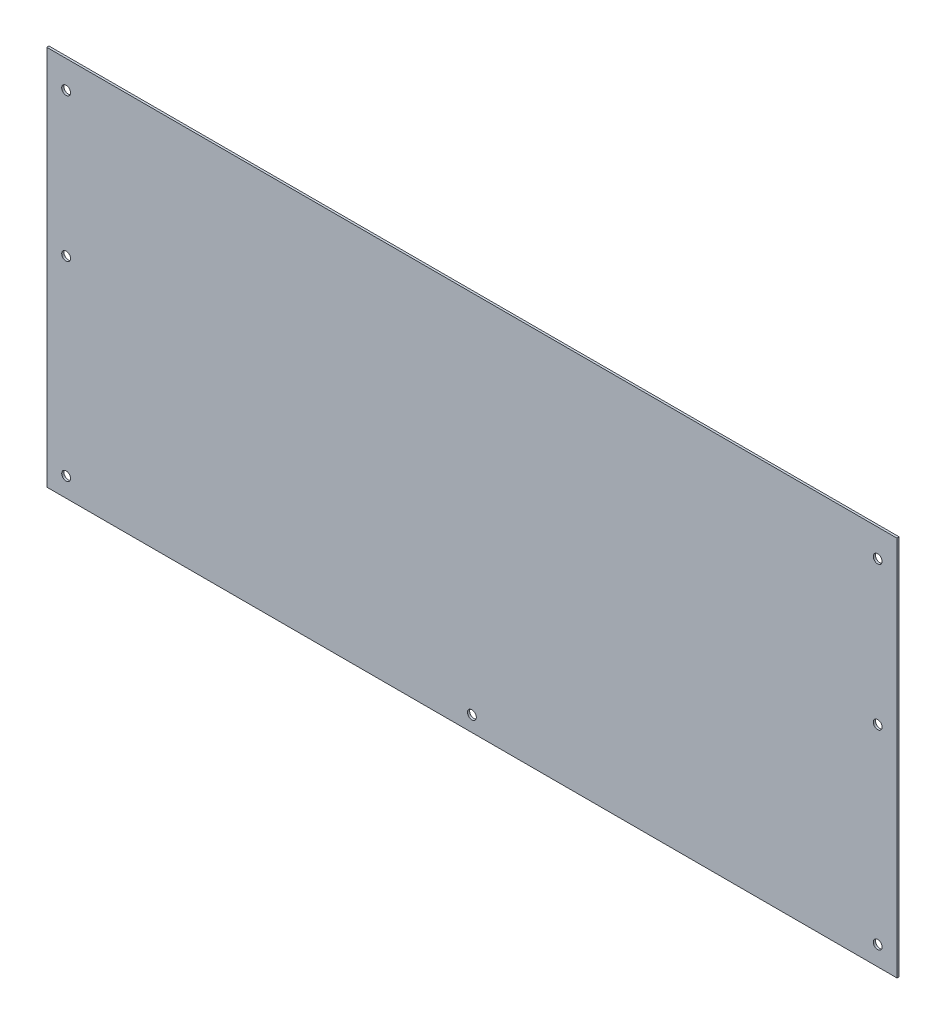
ISO-10303-21;
HEADER;
FILE_DESCRIPTION(('STEP AP214'),'2;1');
FILE_NAME('part.step','',(''),(''),'','','');
FILE_SCHEMA(('AUTOMOTIVE_DESIGN { 1 0 10303 214 1 1 1 1 }'));
ENDSEC;
DATA;
#1=APPLICATION_CONTEXT('core data for automotive mechanical design processes');
#2=APPLICATION_PROTOCOL_DEFINITION('international standard','automotive_design',2000,#1);
#3=PRODUCT_CONTEXT('',#1,'mechanical');
#4=PRODUCT('Part','Part','',(#3));
#5=PRODUCT_RELATED_PRODUCT_CATEGORY('part','',(#4));
#6=PRODUCT_DEFINITION_FORMATION('','',#4);
#7=PRODUCT_DEFINITION_CONTEXT('part definition',#1,'design');
#8=PRODUCT_DEFINITION('design','',#6,#7);
#9=PRODUCT_DEFINITION_SHAPE('','',#8);
#10=(LENGTH_UNIT() NAMED_UNIT(*) SI_UNIT(.MILLI.,.METRE.));
#11=(NAMED_UNIT(*) PLANE_ANGLE_UNIT() SI_UNIT($,.RADIAN.));
#12=(NAMED_UNIT(*) SI_UNIT($,.STERADIAN.) SOLID_ANGLE_UNIT());
#13=UNCERTAINTY_MEASURE_WITH_UNIT(LENGTH_MEASURE(1.E-05),#10,'distance_accuracy_value','');
#14=(GEOMETRIC_REPRESENTATION_CONTEXT(3) GLOBAL_UNCERTAINTY_ASSIGNED_CONTEXT((#13)) GLOBAL_UNIT_ASSIGNED_CONTEXT((#10,
#11,#12)) REPRESENTATION_CONTEXT('',''));
#15=CARTESIAN_POINT('',(0.,0.,0.));
#16=DIRECTION('',(0.,0.,1.));
#17=DIRECTION('',(1.,0.,0.));
#18=AXIS2_PLACEMENT_3D('',#15,#16,#17);
#19=CARTESIAN_POINT('',(0.,0.,2.));
#20=DIRECTION('',(0.,0.,1.));
#21=DIRECTION('',(1.,0.,0.));
#22=AXIS2_PLACEMENT_3D('',#19,#20,#21);
#23=PLANE('',#22);
#24=CARTESIAN_POINT('',(752.5,190.,2.));
#25=DIRECTION('',(0.,0.,1.));
#26=DIRECTION('',(-1.,0.,0.));
#27=AXIS2_PLACEMENT_3D('',#24,#25,#26);
#28=CIRCLE('',#27,3.99999999999999);
#29=CARTESIAN_POINT('',(748.5,190.,2.));
#30=VERTEX_POINT('',#29);
#31=EDGE_CURVE('E138',#30,#30,#28,.T.);
#32=ORIENTED_EDGE('',*,*,#31,.F.);
#33=EDGE_LOOP('',(#32));
#34=FACE_BOUND('',#33,.T.);
#35=CARTESIAN_POINT('',(752.5,17.5000000000001,2.));
#36=DIRECTION('',(0.,0.,1.));
#37=DIRECTION('',(-1.,0.,0.));
#38=AXIS2_PLACEMENT_3D('',#35,#36,#37);
#39=CIRCLE('',#38,3.99999999999999);
#40=CARTESIAN_POINT('',(748.5,17.5000000000001,2.));
#41=VERTEX_POINT('',#40);
#42=EDGE_CURVE('E126',#41,#41,#39,.T.);
#43=ORIENTED_EDGE('',*,*,#42,.F.);
#44=EDGE_LOOP('',(#43));
#45=FACE_BOUND('',#44,.T.);
#46=CARTESIAN_POINT('',(17.5,17.5,2.));
#47=DIRECTION('',(0.,0.,1.));
#48=DIRECTION('',(1.,0.,0.));
#49=AXIS2_PLACEMENT_3D('',#46,#47,#48);
#50=CIRCLE('',#49,4.00000000000001);
#51=CARTESIAN_POINT('',(21.5000000000001,17.5,2.));
#52=VERTEX_POINT('',#51);
#53=EDGE_CURVE('E114',#52,#52,#50,.T.);
#54=ORIENTED_EDGE('',*,*,#53,.F.);
#55=EDGE_LOOP('',(#54));
#56=FACE_BOUND('',#55,.T.);
#57=DIRECTION('',(0.,-1.,0.));
#58=VECTOR('',#57,1.);
#59=CARTESIAN_POINT('',(0.,345.,2.));
#60=LINE('',#59,#58);
#61=CARTESIAN_POINT('',(0.,345.,2.));
#62=VERTEX_POINT('',#61);
#63=CARTESIAN_POINT('',(0.,0.,2.));
#64=VERTEX_POINT('',#63);
#65=EDGE_CURVE('E84',#62,#64,#60,.T.);
#66=ORIENTED_EDGE('',*,*,#65,.T.);
#67=DIRECTION('',(1.,0.,0.));
#68=VECTOR('',#67,1.);
#69=CARTESIAN_POINT('',(0.,0.,2.));
#70=LINE('',#69,#68);
#71=CARTESIAN_POINT('',(770.,0.,2.));
#72=VERTEX_POINT('',#71);
#73=EDGE_CURVE('E79',#64,#72,#70,.T.);
#74=ORIENTED_EDGE('',*,*,#73,.T.);
#75=DIRECTION('',(0.,1.,0.));
#76=VECTOR('',#75,1.);
#77=CARTESIAN_POINT('',(770.,0.,2.));
#78=LINE('',#77,#76);
#79=CARTESIAN_POINT('',(770.,345.,2.));
#80=VERTEX_POINT('',#79);
#81=EDGE_CURVE('E82',#72,#80,#78,.T.);
#82=ORIENTED_EDGE('',*,*,#81,.T.);
#83=DIRECTION('',(-1.,0.,0.));
#84=VECTOR('',#83,1.);
#85=CARTESIAN_POINT('',(770.,345.,2.));
#86=LINE('',#85,#84);
#87=EDGE_CURVE('E49',#80,#62,#86,.T.);
#88=ORIENTED_EDGE('',*,*,#87,.T.);
#89=EDGE_LOOP('',(#66,#74,#82,#88));
#90=FACE_BOUND('',#89,.T.);
#91=CARTESIAN_POINT('',(17.5,320.,2.));
#92=DIRECTION('',(0.,0.,1.));
#93=DIRECTION('',(1.,0.,0.));
#94=AXIS2_PLACEMENT_3D('',#91,#92,#93);
#95=CIRCLE('',#94,4.00000000000001);
#96=CARTESIAN_POINT('',(21.5,320.,2.));
#97=VERTEX_POINT('',#96);
#98=EDGE_CURVE('E99',#97,#97,#95,.T.);
#99=ORIENTED_EDGE('',*,*,#98,.F.);
#100=EDGE_LOOP('',(#99));
#101=FACE_BOUND('',#100,.T.);
#102=CARTESIAN_POINT('',(385.,13.9020408444533,2.));
#103=DIRECTION('',(0.,0.,1.));
#104=DIRECTION('',(1.,0.,0.));
#105=AXIS2_PLACEMENT_3D('',#102,#103,#104);
#106=CIRCLE('',#105,3.99999999999999);
#107=CARTESIAN_POINT('',(389.,13.9020408444533,2.));
#108=VERTEX_POINT('',#107);
#109=EDGE_CURVE('E120',#108,#108,#106,.T.);
#110=ORIENTED_EDGE('',*,*,#109,.F.);
#111=EDGE_LOOP('',(#110));
#112=FACE_BOUND('',#111,.T.);
#113=CARTESIAN_POINT('',(17.5,190.,2.));
#114=DIRECTION('',(0.,0.,1.));
#115=DIRECTION('',(1.,0.,0.));
#116=AXIS2_PLACEMENT_3D('',#113,#114,#115);
#117=CIRCLE('',#116,4.);
#118=CARTESIAN_POINT('',(21.5,190.,2.));
#119=VERTEX_POINT('',#118);
#120=EDGE_CURVE('E132',#119,#119,#117,.T.);
#121=ORIENTED_EDGE('',*,*,#120,.F.);
#122=EDGE_LOOP('',(#121));
#123=FACE_BOUND('',#122,.T.);
#124=CARTESIAN_POINT('',(752.5,320.,2.));
#125=DIRECTION('',(0.,0.,1.));
#126=DIRECTION('',(-1.,0.,0.));
#127=AXIS2_PLACEMENT_3D('',#124,#125,#126);
#128=CIRCLE('',#127,3.99999999999987);
#129=CARTESIAN_POINT('',(748.5,320.,2.));
#130=VERTEX_POINT('',#129);
#131=EDGE_CURVE('E144',#130,#130,#128,.T.);
#132=ORIENTED_EDGE('',*,*,#131,.F.);
#133=EDGE_LOOP('',(#132));
#134=FACE_BOUND('',#133,.T.);
#135=ADVANCED_FACE('F32',(#34,#45,#56,#90,#101,#112,#123,#134),#23,.T.);
#136=CARTESIAN_POINT('',(0.,0.,0.));
#137=DIRECTION('',(0.,0.,1.));
#138=DIRECTION('',(1.,0.,0.));
#139=AXIS2_PLACEMENT_3D('',#136,#137,#138);
#140=PLANE('',#139);
#141=CARTESIAN_POINT('',(752.5,190.,0.));
#142=DIRECTION('',(0.,0.,1.));
#143=DIRECTION('',(-1.,0.,0.));
#144=AXIS2_PLACEMENT_3D('',#141,#142,#143);
#145=CIRCLE('',#144,3.99999999999999);
#146=CARTESIAN_POINT('',(748.5,190.,0.));
#147=VERTEX_POINT('',#146);
#148=EDGE_CURVE('E141',#147,#147,#145,.T.);
#149=ORIENTED_EDGE('',*,*,#148,.T.);
#150=EDGE_LOOP('',(#149));
#151=FACE_BOUND('',#150,.T.);
#152=CARTESIAN_POINT('',(752.5,17.5000000000001,0.));
#153=DIRECTION('',(0.,0.,1.));
#154=DIRECTION('',(-1.,0.,0.));
#155=AXIS2_PLACEMENT_3D('',#152,#153,#154);
#156=CIRCLE('',#155,3.99999999999999);
#157=CARTESIAN_POINT('',(748.5,17.5000000000001,0.));
#158=VERTEX_POINT('',#157);
#159=EDGE_CURVE('E129',#158,#158,#156,.T.);
#160=ORIENTED_EDGE('',*,*,#159,.T.);
#161=EDGE_LOOP('',(#160));
#162=FACE_BOUND('',#161,.T.);
#163=CARTESIAN_POINT('',(17.5,17.5,0.));
#164=DIRECTION('',(0.,0.,1.));
#165=DIRECTION('',(1.,0.,0.));
#166=AXIS2_PLACEMENT_3D('',#163,#164,#165);
#167=CIRCLE('',#166,4.00000000000001);
#168=CARTESIAN_POINT('',(21.5000000000001,17.5,0.));
#169=VERTEX_POINT('',#168);
#170=EDGE_CURVE('E117',#169,#169,#167,.T.);
#171=ORIENTED_EDGE('',*,*,#170,.T.);
#172=EDGE_LOOP('',(#171));
#173=FACE_BOUND('',#172,.T.);
#174=DIRECTION('',(0.,-1.,0.));
#175=VECTOR('',#174,1.);
#176=CARTESIAN_POINT('',(0.,345.,0.));
#177=LINE('',#176,#175);
#178=CARTESIAN_POINT('',(0.,345.,0.));
#179=VERTEX_POINT('',#178);
#180=CARTESIAN_POINT('',(0.,0.,0.));
#181=VERTEX_POINT('',#180);
#182=EDGE_CURVE('E96',#179,#181,#177,.T.);
#183=ORIENTED_EDGE('',*,*,#182,.F.);
#184=DIRECTION('',(-1.,0.,0.));
#185=VECTOR('',#184,1.);
#186=CARTESIAN_POINT('',(770.,345.,0.));
#187=LINE('',#186,#185);
#188=CARTESIAN_POINT('',(770.,345.,0.));
#189=VERTEX_POINT('',#188);
#190=EDGE_CURVE('E72',#189,#179,#187,.T.);
#191=ORIENTED_EDGE('',*,*,#190,.F.);
#192=DIRECTION('',(0.,1.,0.));
#193=VECTOR('',#192,1.);
#194=CARTESIAN_POINT('',(770.,0.,0.));
#195=LINE('',#194,#193);
#196=CARTESIAN_POINT('',(770.,0.,0.));
#197=VERTEX_POINT('',#196);
#198=EDGE_CURVE('E66',#197,#189,#195,.T.);
#199=ORIENTED_EDGE('',*,*,#198,.F.);
#200=DIRECTION('',(1.,0.,0.));
#201=VECTOR('',#200,1.);
#202=CARTESIAN_POINT('',(0.,0.,0.));
#203=LINE('',#202,#201);
#204=EDGE_CURVE('E88',#181,#197,#203,.T.);
#205=ORIENTED_EDGE('',*,*,#204,.F.);
#206=EDGE_LOOP('',(#183,#191,#199,#205));
#207=FACE_BOUND('',#206,.T.);
#208=CARTESIAN_POINT('',(17.5,320.,0.));
#209=DIRECTION('',(0.,0.,1.));
#210=DIRECTION('',(1.,0.,0.));
#211=AXIS2_PLACEMENT_3D('',#208,#209,#210);
#212=CIRCLE('',#211,4.00000000000001);
#213=CARTESIAN_POINT('',(21.5,320.,0.));
#214=VERTEX_POINT('',#213);
#215=EDGE_CURVE('E111',#214,#214,#212,.T.);
#216=ORIENTED_EDGE('',*,*,#215,.T.);
#217=EDGE_LOOP('',(#216));
#218=FACE_BOUND('',#217,.T.);
#219=CARTESIAN_POINT('',(385.,13.9020408444533,0.));
#220=DIRECTION('',(0.,0.,1.));
#221=DIRECTION('',(1.,0.,0.));
#222=AXIS2_PLACEMENT_3D('',#219,#220,#221);
#223=CIRCLE('',#222,3.99999999999999);
#224=CARTESIAN_POINT('',(389.,13.9020408444533,0.));
#225=VERTEX_POINT('',#224);
#226=EDGE_CURVE('E123',#225,#225,#223,.T.);
#227=ORIENTED_EDGE('',*,*,#226,.T.);
#228=EDGE_LOOP('',(#227));
#229=FACE_BOUND('',#228,.T.);
#230=CARTESIAN_POINT('',(17.5,190.,0.));
#231=DIRECTION('',(0.,0.,1.));
#232=DIRECTION('',(1.,0.,0.));
#233=AXIS2_PLACEMENT_3D('',#230,#231,#232);
#234=CIRCLE('',#233,4.);
#235=CARTESIAN_POINT('',(21.5,190.,0.));
#236=VERTEX_POINT('',#235);
#237=EDGE_CURVE('E135',#236,#236,#234,.T.);
#238=ORIENTED_EDGE('',*,*,#237,.T.);
#239=EDGE_LOOP('',(#238));
#240=FACE_BOUND('',#239,.T.);
#241=CARTESIAN_POINT('',(752.5,320.,0.));
#242=DIRECTION('',(0.,0.,1.));
#243=DIRECTION('',(-1.,0.,0.));
#244=AXIS2_PLACEMENT_3D('',#241,#242,#243);
#245=CIRCLE('',#244,3.99999999999987);
#246=CARTESIAN_POINT('',(748.5,320.,0.));
#247=VERTEX_POINT('',#246);
#248=EDGE_CURVE('E147',#247,#247,#245,.T.);
#249=ORIENTED_EDGE('',*,*,#248,.T.);
#250=EDGE_LOOP('',(#249));
#251=FACE_BOUND('',#250,.T.);
#252=ADVANCED_FACE('F107',(#151,#162,#173,#207,#218,#229,#240,#251),#140,.F.);
#253=CARTESIAN_POINT('',(0.,345.,2.));
#254=DIRECTION('',(1.,0.,0.));
#255=DIRECTION('',(0.,1.,0.));
#256=AXIS2_PLACEMENT_3D('',#253,#254,#255);
#257=PLANE('',#256);
#258=ORIENTED_EDGE('',*,*,#182,.T.);
#259=DIRECTION('',(0.,0.,-1.));
#260=VECTOR('',#259,1.);
#261=CARTESIAN_POINT('',(0.,0.,2.));
#262=LINE('',#261,#260);
#263=EDGE_CURVE('E11',#64,#181,#262,.T.);
#264=ORIENTED_EDGE('',*,*,#263,.F.);
#265=ORIENTED_EDGE('',*,*,#65,.F.);
#266=DIRECTION('',(0.,0.,-1.));
#267=VECTOR('',#266,1.);
#268=CARTESIAN_POINT('',(0.,345.,2.));
#269=LINE('',#268,#267);
#270=EDGE_CURVE('E92',#62,#179,#269,.T.);
#271=ORIENTED_EDGE('',*,*,#270,.T.);
#272=EDGE_LOOP('',(#258,#264,#265,#271));
#273=FACE_BOUND('',#272,.T.);
#274=ADVANCED_FACE('F34',(#273),#257,.F.);
#275=CARTESIAN_POINT('',(0.,0.,2.));
#276=DIRECTION('',(0.,1.,0.));
#277=DIRECTION('',(0.,0.,1.));
#278=AXIS2_PLACEMENT_3D('',#275,#276,#277);
#279=PLANE('',#278);
#280=ORIENTED_EDGE('',*,*,#204,.T.);
#281=DIRECTION('',(0.,0.,-1.));
#282=VECTOR('',#281,1.);
#283=CARTESIAN_POINT('',(770.,0.,2.));
#284=LINE('',#283,#282);
#285=EDGE_CURVE('E41',#72,#197,#284,.T.);
#286=ORIENTED_EDGE('',*,*,#285,.F.);
#287=ORIENTED_EDGE('',*,*,#73,.F.);
#288=ORIENTED_EDGE('',*,*,#263,.T.);
#289=EDGE_LOOP('',(#280,#286,#287,#288));
#290=FACE_BOUND('',#289,.T.);
#291=ADVANCED_FACE('F87',(#290),#279,.F.);
#292=CARTESIAN_POINT('',(770.,0.,2.));
#293=DIRECTION('',(-1.,0.,0.));
#294=DIRECTION('',(0.,0.,1.));
#295=AXIS2_PLACEMENT_3D('',#292,#293,#294);
#296=PLANE('',#295);
#297=ORIENTED_EDGE('',*,*,#198,.T.);
#298=DIRECTION('',(0.,0.,-1.));
#299=VECTOR('',#298,1.);
#300=CARTESIAN_POINT('',(770.,345.,2.));
#301=LINE('',#300,#299);
#302=EDGE_CURVE('E89',#80,#189,#301,.T.);
#303=ORIENTED_EDGE('',*,*,#302,.F.);
#304=ORIENTED_EDGE('',*,*,#81,.F.);
#305=ORIENTED_EDGE('',*,*,#285,.T.);
#306=EDGE_LOOP('',(#297,#303,#304,#305));
#307=FACE_BOUND('',#306,.T.);
#308=ADVANCED_FACE('F90',(#307),#296,.F.);
#309=CARTESIAN_POINT('',(770.,345.,2.));
#310=DIRECTION('',(0.,-1.,0.));
#311=DIRECTION('',(1.,0.,0.));
#312=AXIS2_PLACEMENT_3D('',#309,#310,#311);
#313=PLANE('',#312);
#314=ORIENTED_EDGE('',*,*,#190,.T.);
#315=ORIENTED_EDGE('',*,*,#270,.F.);
#316=ORIENTED_EDGE('',*,*,#87,.F.);
#317=ORIENTED_EDGE('',*,*,#302,.T.);
#318=EDGE_LOOP('',(#314,#315,#316,#317));
#319=FACE_BOUND('',#318,.T.);
#320=ADVANCED_FACE('F104',(#319),#313,.F.);
#321=CARTESIAN_POINT('',(17.5,320.,2.));
#322=DIRECTION('',(0.,0.,-1.));
#323=DIRECTION('',(-1.,0.,0.));
#324=AXIS2_PLACEMENT_3D('',#321,#322,#323);
#325=CYLINDRICAL_SURFACE('',#324,4.00000000000001);
#326=ORIENTED_EDGE('',*,*,#98,.T.);
#327=EDGE_LOOP('',(#326));
#328=FACE_BOUND('',#327,.T.);
#329=ORIENTED_EDGE('',*,*,#215,.F.);
#330=EDGE_LOOP('',(#329));
#331=FACE_BOUND('',#330,.T.);
#332=ADVANCED_FACE('F167',(#328,#331),#325,.F.);
#333=CARTESIAN_POINT('',(17.5,17.5,2.));
#334=DIRECTION('',(0.,0.,-1.));
#335=DIRECTION('',(-1.,0.,0.));
#336=AXIS2_PLACEMENT_3D('',#333,#334,#335);
#337=CYLINDRICAL_SURFACE('',#336,4.00000000000001);
#338=ORIENTED_EDGE('',*,*,#53,.T.);
#339=EDGE_LOOP('',(#338));
#340=FACE_BOUND('',#339,.T.);
#341=ORIENTED_EDGE('',*,*,#170,.F.);
#342=EDGE_LOOP('',(#341));
#343=FACE_BOUND('',#342,.T.);
#344=ADVANCED_FACE('F213',(#340,#343),#337,.F.);
#345=CARTESIAN_POINT('',(385.,13.9020408444533,2.));
#346=DIRECTION('',(0.,0.,-1.));
#347=DIRECTION('',(-1.,0.,0.));
#348=AXIS2_PLACEMENT_3D('',#345,#346,#347);
#349=CYLINDRICAL_SURFACE('',#348,3.99999999999999);
#350=ORIENTED_EDGE('',*,*,#109,.T.);
#351=EDGE_LOOP('',(#350));
#352=FACE_BOUND('',#351,.T.);
#353=ORIENTED_EDGE('',*,*,#226,.F.);
#354=EDGE_LOOP('',(#353));
#355=FACE_BOUND('',#354,.T.);
#356=ADVANCED_FACE('F221',(#352,#355),#349,.F.);
#357=CARTESIAN_POINT('',(752.5,17.5000000000001,2.));
#358=DIRECTION('',(0.,0.,-1.));
#359=DIRECTION('',(-1.,0.,0.));
#360=AXIS2_PLACEMENT_3D('',#357,#358,#359);
#361=CYLINDRICAL_SURFACE('',#360,3.99999999999999);
#362=ORIENTED_EDGE('',*,*,#42,.T.);
#363=EDGE_LOOP('',(#362));
#364=FACE_BOUND('',#363,.T.);
#365=ORIENTED_EDGE('',*,*,#159,.F.);
#366=EDGE_LOOP('',(#365));
#367=FACE_BOUND('',#366,.T.);
#368=ADVANCED_FACE('F229',(#364,#367),#361,.F.);
#369=CARTESIAN_POINT('',(17.5,190.,2.));
#370=DIRECTION('',(0.,0.,-1.));
#371=DIRECTION('',(-1.,0.,0.));
#372=AXIS2_PLACEMENT_3D('',#369,#370,#371);
#373=CYLINDRICAL_SURFACE('',#372,4.);
#374=ORIENTED_EDGE('',*,*,#120,.T.);
#375=EDGE_LOOP('',(#374));
#376=FACE_BOUND('',#375,.T.);
#377=ORIENTED_EDGE('',*,*,#237,.F.);
#378=EDGE_LOOP('',(#377));
#379=FACE_BOUND('',#378,.T.);
#380=ADVANCED_FACE('F238',(#376,#379),#373,.F.);
#381=CARTESIAN_POINT('',(752.5,190.,2.));
#382=DIRECTION('',(0.,0.,-1.));
#383=DIRECTION('',(-1.,0.,0.));
#384=AXIS2_PLACEMENT_3D('',#381,#382,#383);
#385=CYLINDRICAL_SURFACE('',#384,3.99999999999999);
#386=ORIENTED_EDGE('',*,*,#31,.T.);
#387=EDGE_LOOP('',(#386));
#388=FACE_BOUND('',#387,.T.);
#389=ORIENTED_EDGE('',*,*,#148,.F.);
#390=EDGE_LOOP('',(#389));
#391=FACE_BOUND('',#390,.T.);
#392=ADVANCED_FACE('F247',(#388,#391),#385,.F.);
#393=CARTESIAN_POINT('',(752.5,320.,2.));
#394=DIRECTION('',(0.,0.,-1.));
#395=DIRECTION('',(-1.,0.,0.));
#396=AXIS2_PLACEMENT_3D('',#393,#394,#395);
#397=CYLINDRICAL_SURFACE('',#396,3.99999999999987);
#398=ORIENTED_EDGE('',*,*,#131,.T.);
#399=EDGE_LOOP('',(#398));
#400=FACE_BOUND('',#399,.T.);
#401=ORIENTED_EDGE('',*,*,#248,.F.);
#402=EDGE_LOOP('',(#401));
#403=FACE_BOUND('',#402,.T.);
#404=ADVANCED_FACE('F153',(#400,#403),#397,.F.);
#405=CLOSED_SHELL('',(#135,#252,#274,#291,#308,#320,#332,#344,#356,#368,#380,#392,#404));
#406=MANIFOLD_SOLID_BREP('B2',#405);
#407=ADVANCED_BREP_SHAPE_REPRESENTATION('',(#18,#406),#14);
#408=SHAPE_DEFINITION_REPRESENTATION(#9,#407);
ENDSEC;
END-ISO-10303-21;
